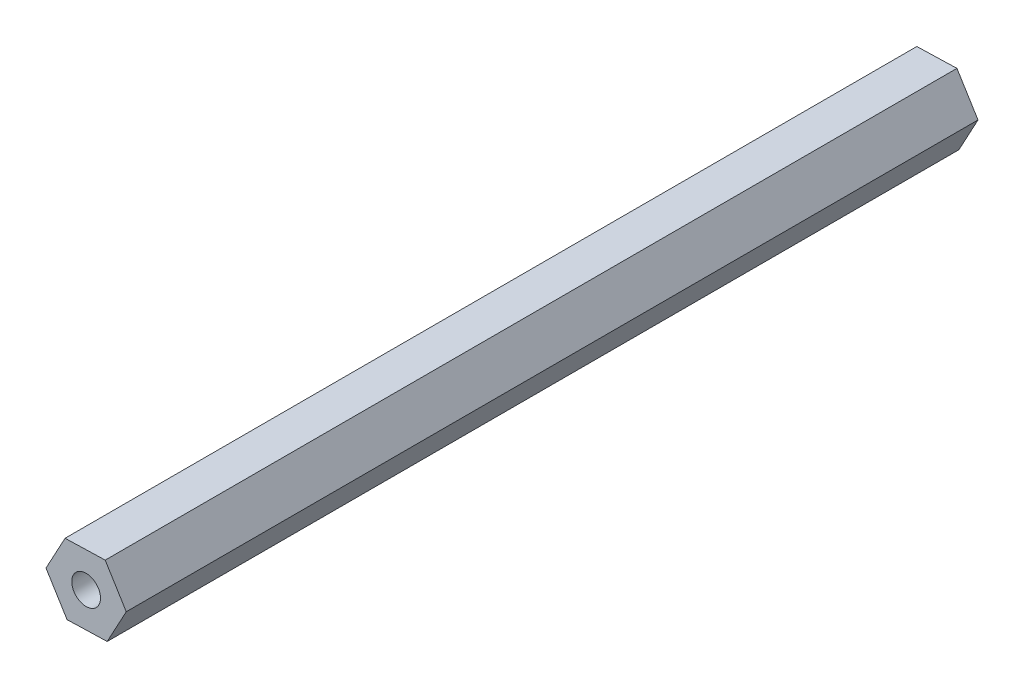
ISO-10303-21;
HEADER;
FILE_DESCRIPTION(('STEP AP214'),'2;1');
FILE_NAME('part.step','',(''),(''),'','','');
FILE_SCHEMA(('AUTOMOTIVE_DESIGN { 1 0 10303 214 1 1 1 1 }'));
ENDSEC;
DATA;
#1=APPLICATION_CONTEXT('core data for automotive mechanical design processes');
#2=APPLICATION_PROTOCOL_DEFINITION('international standard','automotive_design',2000,#1);
#3=PRODUCT_CONTEXT('',#1,'mechanical');
#4=PRODUCT('Part','Part','',(#3));
#5=PRODUCT_RELATED_PRODUCT_CATEGORY('part','',(#4));
#6=PRODUCT_DEFINITION_FORMATION('','',#4);
#7=PRODUCT_DEFINITION_CONTEXT('part definition',#1,'design');
#8=PRODUCT_DEFINITION('design','',#6,#7);
#9=PRODUCT_DEFINITION_SHAPE('','',#8);
#10=(LENGTH_UNIT() NAMED_UNIT(*) SI_UNIT(.MILLI.,.METRE.));
#11=(NAMED_UNIT(*) PLANE_ANGLE_UNIT() SI_UNIT($,.RADIAN.));
#12=(NAMED_UNIT(*) SI_UNIT($,.STERADIAN.) SOLID_ANGLE_UNIT());
#13=UNCERTAINTY_MEASURE_WITH_UNIT(LENGTH_MEASURE(1.E-05),#10,'distance_accuracy_value','');
#14=(GEOMETRIC_REPRESENTATION_CONTEXT(3) GLOBAL_UNCERTAINTY_ASSIGNED_CONTEXT((#13)) GLOBAL_UNIT_ASSIGNED_CONTEXT((#10,
#11,#12)) REPRESENTATION_CONTEXT('',''));
#15=CARTESIAN_POINT('',(0.,0.,0.));
#16=DIRECTION('',(0.,0.,1.));
#17=DIRECTION('',(1.,0.,0.));
#18=AXIS2_PLACEMENT_3D('',#15,#16,#17);
#19=CARTESIAN_POINT('',(7.32939522682642,0.208083978978387,155.575));
#20=DIRECTION('',(-0.851487151836519,-0.5243754668721,0.));
#21=DIRECTION('',(0.5243754668721,-0.851487151836519,0.));
#22=AXIS2_PLACEMENT_3D('',#19,#20,#21);
#23=PLANE('',#22);
#24=DIRECTION('',(-0.5243754668721,0.851487151836519,0.));
#25=VECTOR('',#24,1.);
#26=CARTESIAN_POINT('',(7.32939522682642,0.208083978978387,0.));
#27=LINE('',#26,#25);
#28=CARTESIAN_POINT('',(7.32939522682642,0.208083978978387,0.));
#29=VERTEX_POINT('',#28);
#30=CARTESIAN_POINT('',(3.48449160149738,6.45148445029728,0.));
#31=VERTEX_POINT('',#30);
#32=EDGE_CURVE('E120',#29,#31,#27,.T.);
#33=ORIENTED_EDGE('',*,*,#32,.T.);
#34=DIRECTION('',(0.,0.,-1.));
#35=VECTOR('',#34,1.);
#36=CARTESIAN_POINT('',(3.48449160149738,6.45148445029728,155.575));
#37=LINE('',#36,#35);
#38=CARTESIAN_POINT('',(3.48449160149738,6.45148445029728,155.575));
#39=VERTEX_POINT('',#38);
#40=EDGE_CURVE('E11',#39,#31,#37,.T.);
#41=ORIENTED_EDGE('',*,*,#40,.F.);
#42=DIRECTION('',(-0.5243754668721,0.851487151836519,0.));
#43=VECTOR('',#42,1.);
#44=CARTESIAN_POINT('',(7.32939522682642,0.208083978978387,155.575));
#45=LINE('',#44,#43);
#46=CARTESIAN_POINT('',(7.32939522682642,0.208083978978387,155.575));
#47=VERTEX_POINT('',#46);
#48=EDGE_CURVE('E131',#47,#39,#45,.T.);
#49=ORIENTED_EDGE('',*,*,#48,.F.);
#50=DIRECTION('',(0.,0.,-1.));
#51=VECTOR('',#50,1.);
#52=CARTESIAN_POINT('',(7.32939522682642,0.208083978978387,155.575));
#53=LINE('',#52,#51);
#54=EDGE_CURVE('E116',#47,#29,#53,.T.);
#55=ORIENTED_EDGE('',*,*,#54,.T.);
#56=EDGE_LOOP('',(#33,#41,#49,#55));
#57=FACE_BOUND('',#56,.T.);
#58=ADVANCED_FACE('F36',(#57),#23,.F.);
#59=CARTESIAN_POINT('',(3.48449160149738,6.45148445029728,155.575));
#60=DIRECTION('',(0.0283788995143039,-0.999597237922533,0.));
#61=DIRECTION('',(0.999597237922533,0.0283788995143039,0.));
#62=AXIS2_PLACEMENT_3D('',#59,#60,#61);
#63=PLANE('',#62);
#64=DIRECTION('',(-0.999597237922533,-0.0283788995143039,0.));
#65=VECTOR('',#64,1.);
#66=CARTESIAN_POINT('',(3.48449160149738,6.45148445029728,0.));
#67=LINE('',#66,#65);
#68=CARTESIAN_POINT('',(-3.84490362532904,6.24340047131889,0.));
#69=VERTEX_POINT('',#68);
#70=EDGE_CURVE('E123',#31,#69,#67,.T.);
#71=ORIENTED_EDGE('',*,*,#70,.T.);
#72=DIRECTION('',(0.,0.,-1.));
#73=VECTOR('',#72,1.);
#74=CARTESIAN_POINT('',(-3.84490362532904,6.24340047131889,155.575));
#75=LINE('',#74,#73);
#76=CARTESIAN_POINT('',(-3.84490362532904,6.24340047131889,155.575));
#77=VERTEX_POINT('',#76);
#78=EDGE_CURVE('E44',#77,#69,#75,.T.);
#79=ORIENTED_EDGE('',*,*,#78,.F.);
#80=DIRECTION('',(-0.999597237922533,-0.0283788995143039,0.));
#81=VECTOR('',#80,1.);
#82=CARTESIAN_POINT('',(3.48449160149738,6.45148445029728,155.575));
#83=LINE('',#82,#81);
#84=EDGE_CURVE('E89',#39,#77,#83,.T.);
#85=ORIENTED_EDGE('',*,*,#84,.F.);
#86=ORIENTED_EDGE('',*,*,#40,.T.);
#87=EDGE_LOOP('',(#71,#79,#85,#86));
#88=FACE_BOUND('',#87,.T.);
#89=ADVANCED_FACE('F156',(#88),#63,.F.);
#90=CARTESIAN_POINT('',(-3.84490362532904,6.24340047131889,155.575));
#91=DIRECTION('',(0.879866051350823,-0.475221771050433,0.));
#92=DIRECTION('',(0.475221771050433,0.879866051350823,0.));
#93=AXIS2_PLACEMENT_3D('',#90,#91,#92);
#94=PLANE('',#93);
#95=DIRECTION('',(-0.475221771050433,-0.879866051350823,0.));
#96=VECTOR('',#95,1.);
#97=CARTESIAN_POINT('',(-3.84490362532904,6.24340047131889,0.));
#98=LINE('',#97,#96);
#99=CARTESIAN_POINT('',(-7.32939522682641,-0.208083978978388,0.));
#100=VERTEX_POINT('',#99);
#101=EDGE_CURVE('E126',#69,#100,#98,.T.);
#102=ORIENTED_EDGE('',*,*,#101,.T.);
#103=DIRECTION('',(0.,0.,-1.));
#104=VECTOR('',#103,1.);
#105=CARTESIAN_POINT('',(-7.32939522682641,-0.208083978978388,155.575));
#106=LINE('',#105,#104);
#107=CARTESIAN_POINT('',(-7.32939522682641,-0.208083978978388,155.575));
#108=VERTEX_POINT('',#107);
#109=EDGE_CURVE('E111',#108,#100,#106,.T.);
#110=ORIENTED_EDGE('',*,*,#109,.F.);
#111=DIRECTION('',(-0.475221771050433,-0.879866051350823,0.));
#112=VECTOR('',#111,1.);
#113=CARTESIAN_POINT('',(-3.84490362532904,6.24340047131889,155.575));
#114=LINE('',#113,#112);
#115=EDGE_CURVE('E102',#77,#108,#114,.T.);
#116=ORIENTED_EDGE('',*,*,#115,.F.);
#117=ORIENTED_EDGE('',*,*,#78,.T.);
#118=EDGE_LOOP('',(#102,#110,#116,#117));
#119=FACE_BOUND('',#118,.T.);
#120=ADVANCED_FACE('F137',(#119),#94,.F.);
#121=CARTESIAN_POINT('',(-7.32939522682641,-0.208083978978388,155.575));
#122=DIRECTION('',(0.851487151836519,0.5243754668721,0.));
#123=DIRECTION('',(-0.5243754668721,0.851487151836519,0.));
#124=AXIS2_PLACEMENT_3D('',#121,#122,#123);
#125=PLANE('',#124);
#126=DIRECTION('',(0.5243754668721,-0.851487151836519,0.));
#127=VECTOR('',#126,1.);
#128=CARTESIAN_POINT('',(-7.32939522682641,-0.208083978978388,0.));
#129=LINE('',#128,#127);
#130=CARTESIAN_POINT('',(-3.48449160149737,-6.45148445029728,0.));
#131=VERTEX_POINT('',#130);
#132=EDGE_CURVE('E110',#100,#131,#129,.T.);
#133=ORIENTED_EDGE('',*,*,#132,.T.);
#134=DIRECTION('',(0.,0.,-1.));
#135=VECTOR('',#134,1.);
#136=CARTESIAN_POINT('',(-3.48449160149737,-6.45148445029728,155.575));
#137=LINE('',#136,#135);
#138=CARTESIAN_POINT('',(-3.48449160149737,-6.45148445029728,155.575));
#139=VERTEX_POINT('',#138);
#140=EDGE_CURVE('E107',#139,#131,#137,.T.);
#141=ORIENTED_EDGE('',*,*,#140,.F.);
#142=DIRECTION('',(0.5243754668721,-0.851487151836519,0.));
#143=VECTOR('',#142,1.);
#144=CARTESIAN_POINT('',(-7.32939522682641,-0.208083978978388,155.575));
#145=LINE('',#144,#143);
#146=EDGE_CURVE('E96',#108,#139,#145,.T.);
#147=ORIENTED_EDGE('',*,*,#146,.F.);
#148=ORIENTED_EDGE('',*,*,#109,.T.);
#149=EDGE_LOOP('',(#133,#141,#147,#148));
#150=FACE_BOUND('',#149,.T.);
#151=ADVANCED_FACE('F108',(#150),#125,.F.);
#152=CARTESIAN_POINT('',(-3.48449160149737,-6.45148445029728,155.575));
#153=DIRECTION('',(-0.0283788995143042,0.999597237922533,0.));
#154=DIRECTION('',(-0.999597237922533,-0.0283788995143042,0.));
#155=AXIS2_PLACEMENT_3D('',#152,#153,#154);
#156=PLANE('',#155);
#157=DIRECTION('',(0.999597237922533,0.0283788995143042,0.));
#158=VECTOR('',#157,1.);
#159=CARTESIAN_POINT('',(-3.48449160149737,-6.45148445029728,0.));
#160=LINE('',#159,#158);
#161=CARTESIAN_POINT('',(3.84490362532904,-6.24340047131889,0.));
#162=VERTEX_POINT('',#161);
#163=EDGE_CURVE('E75',#131,#162,#160,.T.);
#164=ORIENTED_EDGE('',*,*,#163,.T.);
#165=DIRECTION('',(0.,0.,-1.));
#166=VECTOR('',#165,1.);
#167=CARTESIAN_POINT('',(3.84490362532904,-6.24340047131889,155.575));
#168=LINE('',#167,#166);
#169=CARTESIAN_POINT('',(3.84490362532904,-6.24340047131889,155.575));
#170=VERTEX_POINT('',#169);
#171=EDGE_CURVE('E112',#170,#162,#168,.T.);
#172=ORIENTED_EDGE('',*,*,#171,.F.);
#173=DIRECTION('',(0.999597237922533,0.0283788995143042,0.));
#174=VECTOR('',#173,1.);
#175=CARTESIAN_POINT('',(-3.48449160149737,-6.45148445029728,155.575));
#176=LINE('',#175,#174);
#177=EDGE_CURVE('E100',#139,#170,#176,.T.);
#178=ORIENTED_EDGE('',*,*,#177,.F.);
#179=ORIENTED_EDGE('',*,*,#140,.T.);
#180=EDGE_LOOP('',(#164,#172,#178,#179));
#181=FACE_BOUND('',#180,.T.);
#182=ADVANCED_FACE('F114',(#181),#156,.F.);
#183=CARTESIAN_POINT('',(3.84490362532904,-6.24340047131889,155.575));
#184=DIRECTION('',(-0.879866051350823,0.475221771050433,0.));
#185=DIRECTION('',(-0.475221771050433,-0.879866051350823,0.));
#186=AXIS2_PLACEMENT_3D('',#183,#184,#185);
#187=PLANE('',#186);
#188=DIRECTION('',(0.475221771050433,0.879866051350823,0.));
#189=VECTOR('',#188,1.);
#190=CARTESIAN_POINT('',(3.84490362532904,-6.24340047131889,0.));
#191=LINE('',#190,#189);
#192=EDGE_CURVE('E81',#162,#29,#191,.T.);
#193=ORIENTED_EDGE('',*,*,#192,.T.);
#194=ORIENTED_EDGE('',*,*,#54,.F.);
#195=DIRECTION('',(0.475221771050433,0.879866051350823,0.));
#196=VECTOR('',#195,1.);
#197=CARTESIAN_POINT('',(3.84490362532904,-6.24340047131889,155.575));
#198=LINE('',#197,#196);
#199=EDGE_CURVE('E52',#170,#47,#198,.T.);
#200=ORIENTED_EDGE('',*,*,#199,.F.);
#201=ORIENTED_EDGE('',*,*,#171,.T.);
#202=EDGE_LOOP('',(#193,#194,#200,#201));
#203=FACE_BOUND('',#202,.T.);
#204=ADVANCED_FACE('F144',(#203),#187,.F.);
#205=CARTESIAN_POINT('',(0.,0.,155.575));
#206=DIRECTION('',(0.,0.,1.));
#207=DIRECTION('',(1.,0.,0.));
#208=AXIS2_PLACEMENT_3D('',#205,#206,#207);
#209=PLANE('',#208);
#210=CARTESIAN_POINT('',(0.,0.,155.575));
#211=DIRECTION('',(0.,0.,1.));
#212=DIRECTION('',(1.,0.,0.));
#213=AXIS2_PLACEMENT_3D('',#210,#211,#212);
#214=CIRCLE('',#213,2.6289);
#215=CARTESIAN_POINT('',(2.6289,0.,155.575));
#216=VERTEX_POINT('',#215);
#217=EDGE_CURVE('E239',#216,#216,#214,.T.);
#218=ORIENTED_EDGE('',*,*,#217,.F.);
#219=EDGE_LOOP('',(#218));
#220=FACE_BOUND('',#219,.T.);
#221=ORIENTED_EDGE('',*,*,#48,.T.);
#222=ORIENTED_EDGE('',*,*,#84,.T.);
#223=ORIENTED_EDGE('',*,*,#115,.T.);
#224=ORIENTED_EDGE('',*,*,#146,.T.);
#225=ORIENTED_EDGE('',*,*,#177,.T.);
#226=ORIENTED_EDGE('',*,*,#199,.T.);
#227=EDGE_LOOP('',(#221,#222,#223,#224,#225,#226));
#228=FACE_BOUND('',#227,.T.);
#229=ADVANCED_FACE('F98',(#220,#228),#209,.T.);
#230=CARTESIAN_POINT('',(0.,0.,0.));
#231=DIRECTION('',(0.,0.,1.));
#232=DIRECTION('',(1.,0.,0.));
#233=AXIS2_PLACEMENT_3D('',#230,#231,#232);
#234=PLANE('',#233);
#235=CARTESIAN_POINT('',(0.,0.,0.));
#236=DIRECTION('',(0.,0.,-1.));
#237=DIRECTION('',(-1.,0.,0.));
#238=AXIS2_PLACEMENT_3D('',#235,#236,#237);
#239=CIRCLE('',#238,2.6289);
#240=CARTESIAN_POINT('',(-2.6289,0.,0.));
#241=VERTEX_POINT('',#240);
#242=EDGE_CURVE('E240',#241,#241,#239,.T.);
#243=ORIENTED_EDGE('',*,*,#242,.F.);
#244=EDGE_LOOP('',(#243));
#245=FACE_BOUND('',#244,.T.);
#246=ORIENTED_EDGE('',*,*,#32,.F.);
#247=ORIENTED_EDGE('',*,*,#192,.F.);
#248=ORIENTED_EDGE('',*,*,#163,.F.);
#249=ORIENTED_EDGE('',*,*,#132,.F.);
#250=ORIENTED_EDGE('',*,*,#101,.F.);
#251=ORIENTED_EDGE('',*,*,#70,.F.);
#252=EDGE_LOOP('',(#246,#247,#248,#249,#250,#251));
#253=FACE_BOUND('',#252,.T.);
#254=ADVANCED_FACE('F140',(#245,#253),#234,.F.);
#255=CARTESIAN_POINT('',(0.,0.,130.175));
#256=DIRECTION('',(0.,0.,1.));
#257=DIRECTION('',(1.,0.,0.));
#258=AXIS2_PLACEMENT_3D('',#255,#256,#257);
#259=CYLINDRICAL_SURFACE('',#258,2.6289);
#260=CARTESIAN_POINT('',(0.,0.,130.175));
#261=DIRECTION('',(0.,0.,1.));
#262=DIRECTION('',(1.,0.,0.));
#263=AXIS2_PLACEMENT_3D('',#260,#261,#262);
#264=CIRCLE('',#263,2.6289);
#265=CARTESIAN_POINT('',(2.6289,0.,130.175));
#266=VERTEX_POINT('',#265);
#267=EDGE_CURVE('E124',#266,#266,#264,.T.);
#268=ORIENTED_EDGE('',*,*,#267,.F.);
#269=EDGE_LOOP('',(#268));
#270=FACE_BOUND('',#269,.T.);
#271=ORIENTED_EDGE('',*,*,#217,.T.);
#272=EDGE_LOOP('',(#271));
#273=FACE_BOUND('',#272,.T.);
#274=ADVANCED_FACE('F191',(#270,#273),#259,.F.);
#275=CARTESIAN_POINT('',(0.,0.,130.175));
#276=DIRECTION('',(0.,0.,1.));
#277=DIRECTION('',(1.,0.,0.));
#278=AXIS2_PLACEMENT_3D('',#275,#276,#277);
#279=PLANE('',#278);
#280=ORIENTED_EDGE('',*,*,#267,.T.);
#281=EDGE_LOOP('',(#280));
#282=FACE_BOUND('',#281,.T.);
#283=ADVANCED_FACE('F196',(#282),#279,.T.);
#284=CARTESIAN_POINT('',(0.,0.,25.4));
#285=DIRECTION('',(0.,0.,-1.));
#286=DIRECTION('',(-1.,0.,0.));
#287=AXIS2_PLACEMENT_3D('',#284,#285,#286);
#288=CYLINDRICAL_SURFACE('',#287,2.6289);
#289=CARTESIAN_POINT('',(0.,0.,25.4));
#290=DIRECTION('',(0.,0.,-1.));
#291=DIRECTION('',(-1.,0.,0.));
#292=AXIS2_PLACEMENT_3D('',#289,#290,#291);
#293=CIRCLE('',#292,2.6289);
#294=CARTESIAN_POINT('',(-2.6289,0.,25.4));
#295=VERTEX_POINT('',#294);
#296=EDGE_CURVE('E238',#295,#295,#293,.T.);
#297=ORIENTED_EDGE('',*,*,#296,.F.);
#298=EDGE_LOOP('',(#297));
#299=FACE_BOUND('',#298,.T.);
#300=ORIENTED_EDGE('',*,*,#242,.T.);
#301=EDGE_LOOP('',(#300));
#302=FACE_BOUND('',#301,.T.);
#303=ADVANCED_FACE('F206',(#299,#302),#288,.F.);
#304=CARTESIAN_POINT('',(0.,0.,25.4));
#305=DIRECTION('',(0.,0.,-1.));
#306=DIRECTION('',(-1.,0.,0.));
#307=AXIS2_PLACEMENT_3D('',#304,#305,#306);
#308=PLANE('',#307);
#309=ORIENTED_EDGE('',*,*,#296,.T.);
#310=EDGE_LOOP('',(#309));
#311=FACE_BOUND('',#310,.T.);
#312=ADVANCED_FACE('F222',(#311),#308,.T.);
#313=CLOSED_SHELL('',(#58,#89,#120,#151,#182,#204,#229,#254,#274,#283,#303,#312));
#314=MANIFOLD_SOLID_BREP('B2',#313);
#315=ADVANCED_BREP_SHAPE_REPRESENTATION('',(#18,#314),#14);
#316=SHAPE_DEFINITION_REPRESENTATION(#9,#315);
ENDSEC;
END-ISO-10303-21;
